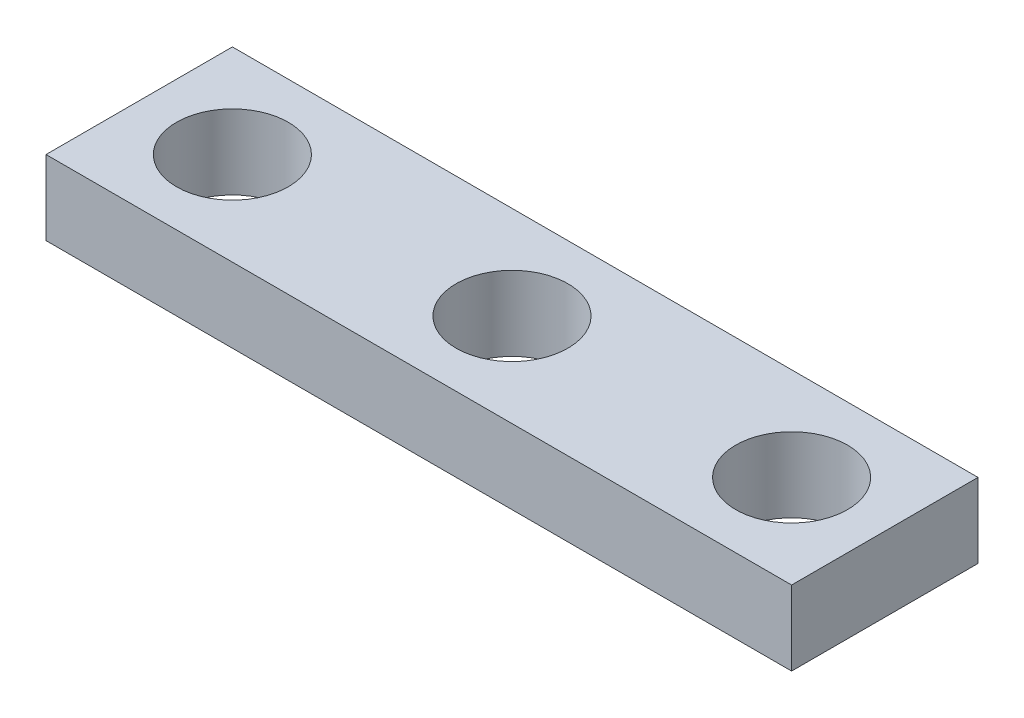
ISO-10303-21;
HEADER;
FILE_DESCRIPTION(('STEP AP214'),'2;1');
FILE_NAME('part.step','',(''),(''),'','','');
FILE_SCHEMA(('AUTOMOTIVE_DESIGN { 1 0 10303 214 1 1 1 1 }'));
ENDSEC;
DATA;
#1=APPLICATION_CONTEXT('core data for automotive mechanical design processes');
#2=APPLICATION_PROTOCOL_DEFINITION('international standard','automotive_design',2000,#1);
#3=PRODUCT_CONTEXT('',#1,'mechanical');
#4=PRODUCT('Part','Part','',(#3));
#5=PRODUCT_RELATED_PRODUCT_CATEGORY('part','',(#4));
#6=PRODUCT_DEFINITION_FORMATION('','',#4);
#7=PRODUCT_DEFINITION_CONTEXT('part definition',#1,'design');
#8=PRODUCT_DEFINITION('design','',#6,#7);
#9=PRODUCT_DEFINITION_SHAPE('','',#8);
#10=(LENGTH_UNIT() NAMED_UNIT(*) SI_UNIT(.MILLI.,.METRE.));
#11=(NAMED_UNIT(*) PLANE_ANGLE_UNIT() SI_UNIT($,.RADIAN.));
#12=(NAMED_UNIT(*) SI_UNIT($,.STERADIAN.) SOLID_ANGLE_UNIT());
#13=UNCERTAINTY_MEASURE_WITH_UNIT(LENGTH_MEASURE(1.E-05),#10,'distance_accuracy_value','');
#14=(GEOMETRIC_REPRESENTATION_CONTEXT(3) GLOBAL_UNCERTAINTY_ASSIGNED_CONTEXT((#13)) GLOBAL_UNIT_ASSIGNED_CONTEXT((#10,
#11,#12)) REPRESENTATION_CONTEXT('',''));
#15=CARTESIAN_POINT('',(0.,0.,0.));
#16=DIRECTION('',(0.,0.,1.));
#17=DIRECTION('',(1.,0.,0.));
#18=AXIS2_PLACEMENT_3D('',#15,#16,#17);
#19=CARTESIAN_POINT('',(0.,2.54,0.));
#20=DIRECTION('',(0.,1.,0.));
#21=DIRECTION('',(0.,0.,1.));
#22=AXIS2_PLACEMENT_3D('',#19,#20,#21);
#23=PLANE('',#22);
#24=CARTESIAN_POINT('',(9.525,2.54,0.));
#25=DIRECTION('',(0.,1.,0.));
#26=DIRECTION('',(0.,0.,-1.));
#27=AXIS2_PLACEMENT_3D('',#24,#25,#26);
#28=CIRCLE('',#27,1.905);
#29=CARTESIAN_POINT('',(9.525,2.54,-1.905));
#30=VERTEX_POINT('',#29);
#31=EDGE_CURVE('E140',#30,#30,#28,.T.);
#32=ORIENTED_EDGE('',*,*,#31,.F.);
#33=EDGE_LOOP('',(#32));
#34=FACE_BOUND('',#33,.T.);
#35=DIRECTION('',(0.,0.,1.));
#36=VECTOR('',#35,1.);
#37=CARTESIAN_POINT('',(-12.7,2.54,-3.175));
#38=LINE('',#37,#36);
#39=CARTESIAN_POINT('',(-12.7,2.54,-3.175));
#40=VERTEX_POINT('',#39);
#41=CARTESIAN_POINT('',(-12.7,2.54,3.175));
#42=VERTEX_POINT('',#41);
#43=EDGE_CURVE('E98',#40,#42,#38,.T.);
#44=ORIENTED_EDGE('',*,*,#43,.T.);
#45=DIRECTION('',(1.,0.,0.));
#46=VECTOR('',#45,1.);
#47=CARTESIAN_POINT('',(-12.7,2.54,3.175));
#48=LINE('',#47,#46);
#49=CARTESIAN_POINT('',(12.7,2.54,3.175));
#50=VERTEX_POINT('',#49);
#51=EDGE_CURVE('E93',#42,#50,#48,.T.);
#52=ORIENTED_EDGE('',*,*,#51,.T.);
#53=DIRECTION('',(0.,0.,-1.));
#54=VECTOR('',#53,1.);
#55=CARTESIAN_POINT('',(12.7,2.54,-3.175));
#56=LINE('',#55,#54);
#57=CARTESIAN_POINT('',(12.7,2.54,-3.175));
#58=VERTEX_POINT('',#57);
#59=EDGE_CURVE('E96',#50,#58,#56,.T.);
#60=ORIENTED_EDGE('',*,*,#59,.T.);
#61=DIRECTION('',(-1.,0.,0.));
#62=VECTOR('',#61,1.);
#63=CARTESIAN_POINT('',(12.7,2.54,-3.175));
#64=LINE('',#63,#62);
#65=EDGE_CURVE('E63',#58,#40,#64,.T.);
#66=ORIENTED_EDGE('',*,*,#65,.T.);
#67=EDGE_LOOP('',(#44,#52,#60,#66));
#68=FACE_BOUND('',#67,.T.);
#69=CARTESIAN_POINT('',(-9.525,2.54,0.));
#70=DIRECTION('',(0.,1.,0.));
#71=DIRECTION('',(0.,0.,1.));
#72=AXIS2_PLACEMENT_3D('',#69,#70,#71);
#73=CIRCLE('',#72,1.905);
#74=CARTESIAN_POINT('',(-9.525,2.54,1.905));
#75=VERTEX_POINT('',#74);
#76=EDGE_CURVE('E118',#75,#75,#73,.T.);
#77=ORIENTED_EDGE('',*,*,#76,.F.);
#78=EDGE_LOOP('',(#77));
#79=FACE_BOUND('',#78,.T.);
#80=CARTESIAN_POINT('',(0.,2.54,0.));
#81=DIRECTION('',(0.,1.,0.));
#82=DIRECTION('',(0.,0.,1.));
#83=AXIS2_PLACEMENT_3D('',#80,#81,#82);
#84=CIRCLE('',#83,1.905);
#85=CARTESIAN_POINT('',(0.,2.54,1.905));
#86=VERTEX_POINT('',#85);
#87=EDGE_CURVE('E148',#86,#86,#84,.T.);
#88=ORIENTED_EDGE('',*,*,#87,.F.);
#89=EDGE_LOOP('',(#88));
#90=FACE_BOUND('',#89,.T.);
#91=ADVANCED_FACE('F45',(#34,#68,#79,#90),#23,.T.);
#92=CARTESIAN_POINT('',(0.,0.,0.));
#93=DIRECTION('',(0.,1.,0.));
#94=DIRECTION('',(0.,0.,1.));
#95=AXIS2_PLACEMENT_3D('',#92,#93,#94);
#96=PLANE('',#95);
#97=DIRECTION('',(0.,0.,1.));
#98=VECTOR('',#97,1.);
#99=CARTESIAN_POINT('',(-12.7,0.,-3.175));
#100=LINE('',#99,#98);
#101=CARTESIAN_POINT('',(-12.7,0.,-3.175));
#102=VERTEX_POINT('',#101);
#103=CARTESIAN_POINT('',(-12.7,0.,3.175));
#104=VERTEX_POINT('',#103);
#105=EDGE_CURVE('E114',#102,#104,#100,.T.);
#106=ORIENTED_EDGE('',*,*,#105,.F.);
#107=DIRECTION('',(-1.,0.,0.));
#108=VECTOR('',#107,1.);
#109=CARTESIAN_POINT('',(12.7,0.,-3.175));
#110=LINE('',#109,#108);
#111=CARTESIAN_POINT('',(12.7,0.,-3.175));
#112=VERTEX_POINT('',#111);
#113=EDGE_CURVE('E86',#112,#102,#110,.T.);
#114=ORIENTED_EDGE('',*,*,#113,.F.);
#115=DIRECTION('',(0.,0.,-1.));
#116=VECTOR('',#115,1.);
#117=CARTESIAN_POINT('',(12.7,0.,-3.175));
#118=LINE('',#117,#116);
#119=CARTESIAN_POINT('',(12.7,0.,3.175));
#120=VERTEX_POINT('',#119);
#121=EDGE_CURVE('E80',#120,#112,#118,.T.);
#122=ORIENTED_EDGE('',*,*,#121,.F.);
#123=DIRECTION('',(1.,0.,0.));
#124=VECTOR('',#123,1.);
#125=CARTESIAN_POINT('',(-12.7,0.,3.175));
#126=LINE('',#125,#124);
#127=EDGE_CURVE('E103',#104,#120,#126,.T.);
#128=ORIENTED_EDGE('',*,*,#127,.F.);
#129=EDGE_LOOP('',(#106,#114,#122,#128));
#130=FACE_BOUND('',#129,.T.);
#131=CARTESIAN_POINT('',(-9.525,0.,0.));
#132=DIRECTION('',(0.,1.,0.));
#133=DIRECTION('',(0.,0.,1.));
#134=AXIS2_PLACEMENT_3D('',#131,#132,#133);
#135=CIRCLE('',#134,1.905);
#136=CARTESIAN_POINT('',(-9.525,0.,1.905));
#137=VERTEX_POINT('',#136);
#138=EDGE_CURVE('E136',#137,#137,#135,.T.);
#139=ORIENTED_EDGE('',*,*,#138,.T.);
#140=EDGE_LOOP('',(#139));
#141=FACE_BOUND('',#140,.T.);
#142=CARTESIAN_POINT('',(9.525,0.,0.));
#143=DIRECTION('',(0.,1.,0.));
#144=DIRECTION('',(0.,0.,-1.));
#145=AXIS2_PLACEMENT_3D('',#142,#143,#144);
#146=CIRCLE('',#145,1.905);
#147=CARTESIAN_POINT('',(9.525,0.,-1.905));
#148=VERTEX_POINT('',#147);
#149=EDGE_CURVE('E144',#148,#148,#146,.T.);
#150=ORIENTED_EDGE('',*,*,#149,.T.);
#151=EDGE_LOOP('',(#150));
#152=FACE_BOUND('',#151,.T.);
#153=CARTESIAN_POINT('',(0.,0.,0.));
#154=DIRECTION('',(0.,1.,0.));
#155=DIRECTION('',(0.,0.,1.));
#156=AXIS2_PLACEMENT_3D('',#153,#154,#155);
#157=CIRCLE('',#156,1.905);
#158=CARTESIAN_POINT('',(0.,0.,1.905));
#159=VERTEX_POINT('',#158);
#160=EDGE_CURVE('E152',#159,#159,#157,.T.);
#161=ORIENTED_EDGE('',*,*,#160,.T.);
#162=EDGE_LOOP('',(#161));
#163=FACE_BOUND('',#162,.T.);
#164=ADVANCED_FACE('F131',(#130,#141,#152,#163),#96,.F.);
#165=CARTESIAN_POINT('',(-12.7,2.54,-3.175));
#166=DIRECTION('',(1.,0.,0.));
#167=DIRECTION('',(0.,0.,-1.));
#168=AXIS2_PLACEMENT_3D('',#165,#166,#167);
#169=PLANE('',#168);
#170=ORIENTED_EDGE('',*,*,#105,.T.);
#171=DIRECTION('',(0.,-1.,0.));
#172=VECTOR('',#171,1.);
#173=CARTESIAN_POINT('',(-12.7,2.54,3.175));
#174=LINE('',#173,#172);
#175=EDGE_CURVE('E11',#42,#104,#174,.T.);
#176=ORIENTED_EDGE('',*,*,#175,.F.);
#177=ORIENTED_EDGE('',*,*,#43,.F.);
#178=DIRECTION('',(0.,-1.,0.));
#179=VECTOR('',#178,1.);
#180=CARTESIAN_POINT('',(-12.7,2.54,-3.175));
#181=LINE('',#180,#179);
#182=EDGE_CURVE('E110',#40,#102,#181,.T.);
#183=ORIENTED_EDGE('',*,*,#182,.T.);
#184=EDGE_LOOP('',(#170,#176,#177,#183));
#185=FACE_BOUND('',#184,.T.);
#186=ADVANCED_FACE('F47',(#185),#169,.F.);
#187=CARTESIAN_POINT('',(-12.7,2.54,3.175));
#188=DIRECTION('',(0.,0.,-1.));
#189=DIRECTION('',(-1.,0.,0.));
#190=AXIS2_PLACEMENT_3D('',#187,#188,#189);
#191=PLANE('',#190);
#192=ORIENTED_EDGE('',*,*,#127,.T.);
#193=DIRECTION('',(0.,-1.,0.));
#194=VECTOR('',#193,1.);
#195=CARTESIAN_POINT('',(12.7,2.54,3.175));
#196=LINE('',#195,#194);
#197=EDGE_CURVE('E55',#50,#120,#196,.T.);
#198=ORIENTED_EDGE('',*,*,#197,.F.);
#199=ORIENTED_EDGE('',*,*,#51,.F.);
#200=ORIENTED_EDGE('',*,*,#175,.T.);
#201=EDGE_LOOP('',(#192,#198,#199,#200));
#202=FACE_BOUND('',#201,.T.);
#203=ADVANCED_FACE('F102',(#202),#191,.F.);
#204=CARTESIAN_POINT('',(12.7,2.54,-3.175));
#205=DIRECTION('',(-1.,0.,0.));
#206=DIRECTION('',(0.,0.,1.));
#207=AXIS2_PLACEMENT_3D('',#204,#205,#206);
#208=PLANE('',#207);
#209=ORIENTED_EDGE('',*,*,#121,.T.);
#210=DIRECTION('',(0.,-1.,0.));
#211=VECTOR('',#210,1.);
#212=CARTESIAN_POINT('',(12.7,2.54,-3.175));
#213=LINE('',#212,#211);
#214=EDGE_CURVE('E105',#58,#112,#213,.T.);
#215=ORIENTED_EDGE('',*,*,#214,.F.);
#216=ORIENTED_EDGE('',*,*,#59,.F.);
#217=ORIENTED_EDGE('',*,*,#197,.T.);
#218=EDGE_LOOP('',(#209,#215,#216,#217));
#219=FACE_BOUND('',#218,.T.);
#220=ADVANCED_FACE('F106',(#219),#208,.F.);
#221=CARTESIAN_POINT('',(12.7,2.54,-3.175));
#222=DIRECTION('',(0.,0.,1.));
#223=DIRECTION('',(1.,0.,0.));
#224=AXIS2_PLACEMENT_3D('',#221,#222,#223);
#225=PLANE('',#224);
#226=ORIENTED_EDGE('',*,*,#113,.T.);
#227=ORIENTED_EDGE('',*,*,#182,.F.);
#228=ORIENTED_EDGE('',*,*,#65,.F.);
#229=ORIENTED_EDGE('',*,*,#214,.T.);
#230=EDGE_LOOP('',(#226,#227,#228,#229));
#231=FACE_BOUND('',#230,.T.);
#232=ADVANCED_FACE('F128',(#231),#225,.F.);
#233=CARTESIAN_POINT('',(-9.525,2.54,0.));
#234=DIRECTION('',(0.,-1.,0.));
#235=DIRECTION('',(0.,0.,-1.));
#236=AXIS2_PLACEMENT_3D('',#233,#234,#235);
#237=CYLINDRICAL_SURFACE('',#236,1.905);
#238=ORIENTED_EDGE('',*,*,#76,.T.);
#239=EDGE_LOOP('',(#238));
#240=FACE_BOUND('',#239,.T.);
#241=ORIENTED_EDGE('',*,*,#138,.F.);
#242=EDGE_LOOP('',(#241));
#243=FACE_BOUND('',#242,.T.);
#244=ADVANCED_FACE('F172',(#240,#243),#237,.F.);
#245=CARTESIAN_POINT('',(9.525,2.54,0.));
#246=DIRECTION('',(0.,-1.,0.));
#247=DIRECTION('',(0.,0.,-1.));
#248=AXIS2_PLACEMENT_3D('',#245,#246,#247);
#249=CYLINDRICAL_SURFACE('',#248,1.905);
#250=ORIENTED_EDGE('',*,*,#31,.T.);
#251=EDGE_LOOP('',(#250));
#252=FACE_BOUND('',#251,.T.);
#253=ORIENTED_EDGE('',*,*,#149,.F.);
#254=EDGE_LOOP('',(#253));
#255=FACE_BOUND('',#254,.T.);
#256=ADVANCED_FACE('F217',(#252,#255),#249,.F.);
#257=CARTESIAN_POINT('',(0.,2.54,0.));
#258=DIRECTION('',(0.,-1.,0.));
#259=DIRECTION('',(0.,0.,-1.));
#260=AXIS2_PLACEMENT_3D('',#257,#258,#259);
#261=CYLINDRICAL_SURFACE('',#260,1.905);
#262=ORIENTED_EDGE('',*,*,#87,.T.);
#263=EDGE_LOOP('',(#262));
#264=FACE_BOUND('',#263,.T.);
#265=ORIENTED_EDGE('',*,*,#160,.F.);
#266=EDGE_LOOP('',(#265));
#267=FACE_BOUND('',#266,.T.);
#268=ADVANCED_FACE('F160',(#264,#267),#261,.F.);
#269=CLOSED_SHELL('',(#91,#164,#186,#203,#220,#232,#244,#256,#268));
#270=MANIFOLD_SOLID_BREP('B2',#269);
#271=ADVANCED_BREP_SHAPE_REPRESENTATION('',(#18,#270),#14);
#272=SHAPE_DEFINITION_REPRESENTATION(#9,#271);
ENDSEC;
END-ISO-10303-21;
